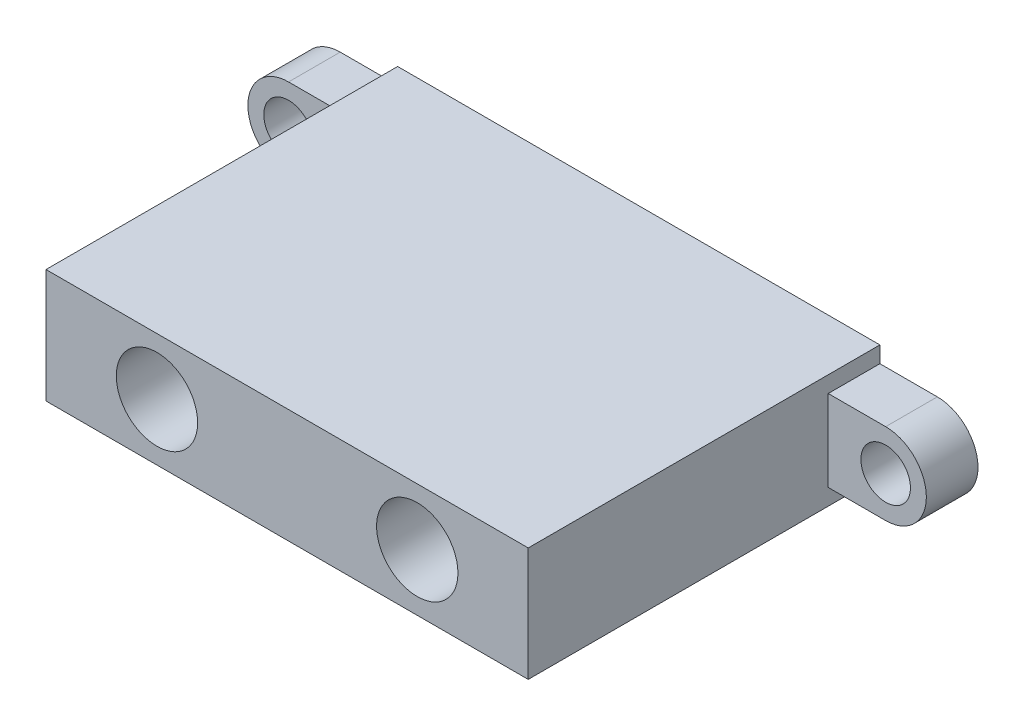
ISO-10303-21;
HEADER;
FILE_DESCRIPTION(('STEP AP214'),'2;1');
FILE_NAME('part.step','',(''),(''),'','','');
FILE_SCHEMA(('AUTOMOTIVE_DESIGN { 1 0 10303 214 1 1 1 1 }'));
ENDSEC;
DATA;
#1=APPLICATION_CONTEXT('core data for automotive mechanical design processes');
#2=APPLICATION_PROTOCOL_DEFINITION('international standard','automotive_design',2000,#1);
#3=PRODUCT_CONTEXT('',#1,'mechanical');
#4=PRODUCT('Part','Part','',(#3));
#5=PRODUCT_RELATED_PRODUCT_CATEGORY('part','',(#4));
#6=PRODUCT_DEFINITION_FORMATION('','',#4);
#7=PRODUCT_DEFINITION_CONTEXT('part definition',#1,'design');
#8=PRODUCT_DEFINITION('design','',#6,#7);
#9=PRODUCT_DEFINITION_SHAPE('','',#8);
#10=(LENGTH_UNIT() NAMED_UNIT(*) SI_UNIT(.MILLI.,.METRE.));
#11=(NAMED_UNIT(*) PLANE_ANGLE_UNIT() SI_UNIT($,.RADIAN.));
#12=(NAMED_UNIT(*) SI_UNIT($,.STERADIAN.) SOLID_ANGLE_UNIT());
#13=UNCERTAINTY_MEASURE_WITH_UNIT(LENGTH_MEASURE(1.E-05),#10,'distance_accuracy_value','');
#14=(GEOMETRIC_REPRESENTATION_CONTEXT(3) GLOBAL_UNCERTAINTY_ASSIGNED_CONTEXT((#13)) GLOBAL_UNIT_ASSIGNED_CONTEXT((#10,
#11,#12)) REPRESENTATION_CONTEXT('',''));
#15=CARTESIAN_POINT('',(0.,0.,0.));
#16=DIRECTION('',(0.,0.,1.));
#17=DIRECTION('',(1.,0.,0.));
#18=AXIS2_PLACEMENT_3D('',#15,#16,#17);
#19=CARTESIAN_POINT('',(0.,0.,21.6154));
#20=DIRECTION('',(1.,0.,0.));
#21=DIRECTION('',(0.,0.,-1.));
#22=AXIS2_PLACEMENT_3D('',#19,#20,#21);
#23=PLANE('',#22);
#24=DIRECTION('',(0.,-1.,0.));
#25=VECTOR('',#24,1.);
#26=CARTESIAN_POINT('',(0.,0.,0.));
#27=LINE('',#26,#25);
#28=CARTESIAN_POINT('',(0.,7.,0.));
#29=VERTEX_POINT('',#28);
#30=CARTESIAN_POINT('',(0.,6.,0.));
#31=VERTEX_POINT('',#30);
#32=EDGE_CURVE('E225',#29,#31,#27,.T.);
#33=ORIENTED_EDGE('',*,*,#32,.T.);
#34=DIRECTION('',(0.,0.,1.));
#35=VECTOR('',#34,1.);
#36=CARTESIAN_POINT('',(0.,6.,21.6154));
#37=LINE('',#36,#35);
#38=CARTESIAN_POINT('',(0.,6.,3.175));
#39=VERTEX_POINT('',#38);
#40=EDGE_CURVE('E56',#31,#39,#37,.T.);
#41=ORIENTED_EDGE('',*,*,#40,.T.);
#42=DIRECTION('',(0.,1.,0.));
#43=VECTOR('',#42,1.);
#44=CARTESIAN_POINT('',(0.,0.,3.175));
#45=LINE('',#44,#43);
#46=CARTESIAN_POINT('',(0.,1.,3.175));
#47=VERTEX_POINT('',#46);
#48=EDGE_CURVE('E60',#47,#39,#45,.T.);
#49=ORIENTED_EDGE('',*,*,#48,.F.);
#50=DIRECTION('',(0.,0.,-1.));
#51=VECTOR('',#50,1.);
#52=CARTESIAN_POINT('',(0.,1.,21.6154));
#53=LINE('',#52,#51);
#54=CARTESIAN_POINT('',(0.,1.,0.));
#55=VERTEX_POINT('',#54);
#56=EDGE_CURVE('E198',#47,#55,#53,.T.);
#57=ORIENTED_EDGE('',*,*,#56,.T.);
#58=CARTESIAN_POINT('',(0.,0.,0.));
#59=VERTEX_POINT('',#58);
#60=EDGE_CURVE('E209',#55,#59,#27,.T.);
#61=ORIENTED_EDGE('',*,*,#60,.T.);
#62=DIRECTION('',(0.,0.,-1.));
#63=VECTOR('',#62,1.);
#64=CARTESIAN_POINT('',(0.,0.,21.6154));
#65=LINE('',#64,#63);
#66=CARTESIAN_POINT('',(0.,0.,21.6154));
#67=VERTEX_POINT('',#66);
#68=EDGE_CURVE('E49',#67,#59,#65,.T.);
#69=ORIENTED_EDGE('',*,*,#68,.F.);
#70=DIRECTION('',(0.,-1.,0.));
#71=VECTOR('',#70,1.);
#72=CARTESIAN_POINT('',(0.,0.,21.6154));
#73=LINE('',#72,#71);
#74=CARTESIAN_POINT('',(0.,7.,21.6154));
#75=VERTEX_POINT('',#74);
#76=EDGE_CURVE('E210',#75,#67,#73,.T.);
#77=ORIENTED_EDGE('',*,*,#76,.F.);
#78=DIRECTION('',(0.,0.,-1.));
#79=VECTOR('',#78,1.);
#80=CARTESIAN_POINT('',(0.,7.,21.6154));
#81=LINE('',#80,#79);
#82=EDGE_CURVE('E224',#75,#29,#81,.T.);
#83=ORIENTED_EDGE('',*,*,#82,.T.);
#84=EDGE_LOOP('',(#33,#41,#49,#57,#61,#69,#77,#83));
#85=FACE_BOUND('',#84,.T.);
#86=ADVANCED_FACE('F41',(#85),#23,.F.);
#87=CARTESIAN_POINT('',(0.,0.,21.6154));
#88=DIRECTION('',(0.,1.,0.));
#89=DIRECTION('',(0.,0.,1.));
#90=AXIS2_PLACEMENT_3D('',#87,#88,#89);
#91=PLANE('',#90);
#92=DIRECTION('',(1.,0.,0.));
#93=VECTOR('',#92,1.);
#94=CARTESIAN_POINT('',(0.,0.,0.));
#95=LINE('',#94,#93);
#96=CARTESIAN_POINT('',(29.6418,0.,0.));
#97=VERTEX_POINT('',#96);
#98=EDGE_CURVE('E228',#59,#97,#95,.T.);
#99=ORIENTED_EDGE('',*,*,#98,.T.);
#100=DIRECTION('',(0.,0.,-1.));
#101=VECTOR('',#100,1.);
#102=CARTESIAN_POINT('',(29.6418,0.,21.6154));
#103=LINE('',#102,#101);
#104=CARTESIAN_POINT('',(29.6418,0.,21.6154));
#105=VERTEX_POINT('',#104);
#106=EDGE_CURVE('E244',#105,#97,#103,.T.);
#107=ORIENTED_EDGE('',*,*,#106,.F.);
#108=DIRECTION('',(1.,0.,0.));
#109=VECTOR('',#108,1.);
#110=CARTESIAN_POINT('',(0.,0.,21.6154));
#111=LINE('',#110,#109);
#112=EDGE_CURVE('E214',#67,#105,#111,.T.);
#113=ORIENTED_EDGE('',*,*,#112,.F.);
#114=ORIENTED_EDGE('',*,*,#68,.T.);
#115=EDGE_LOOP('',(#99,#107,#113,#114));
#116=FACE_BOUND('',#115,.T.);
#117=ADVANCED_FACE('F251',(#116),#91,.F.);
#118=CARTESIAN_POINT('',(29.6418,0.,21.6154));
#119=DIRECTION('',(-1.,0.,0.));
#120=DIRECTION('',(0.,0.,1.));
#121=AXIS2_PLACEMENT_3D('',#118,#119,#120);
#122=PLANE('',#121);
#123=DIRECTION('',(0.,-1.,0.));
#124=VECTOR('',#123,1.);
#125=CARTESIAN_POINT('',(29.6418,0.,3.175));
#126=LINE('',#125,#124);
#127=CARTESIAN_POINT('',(29.6418,6.,3.175));
#128=VERTEX_POINT('',#127);
#129=CARTESIAN_POINT('',(29.6418,1.,3.175));
#130=VERTEX_POINT('',#129);
#131=EDGE_CURVE('E11',#128,#130,#126,.T.);
#132=ORIENTED_EDGE('',*,*,#131,.F.);
#133=DIRECTION('',(0.,0.,-1.));
#134=VECTOR('',#133,1.);
#135=CARTESIAN_POINT('',(29.6418,6.,21.6154));
#136=LINE('',#135,#134);
#137=CARTESIAN_POINT('',(29.6418,6.,0.));
#138=VERTEX_POINT('',#137);
#139=EDGE_CURVE('E201',#128,#138,#136,.T.);
#140=ORIENTED_EDGE('',*,*,#139,.T.);
#141=DIRECTION('',(0.,1.,0.));
#142=VECTOR('',#141,1.);
#143=CARTESIAN_POINT('',(29.6418,0.,0.));
#144=LINE('',#143,#142);
#145=CARTESIAN_POINT('',(29.6418,7.,0.));
#146=VERTEX_POINT('',#145);
#147=EDGE_CURVE('E231',#138,#146,#144,.T.);
#148=ORIENTED_EDGE('',*,*,#147,.T.);
#149=DIRECTION('',(0.,0.,-1.));
#150=VECTOR('',#149,1.);
#151=CARTESIAN_POINT('',(29.6418,7.,21.6154));
#152=LINE('',#151,#150);
#153=CARTESIAN_POINT('',(29.6418,7.,21.6154));
#154=VERTEX_POINT('',#153);
#155=EDGE_CURVE('E240',#154,#146,#152,.T.);
#156=ORIENTED_EDGE('',*,*,#155,.F.);
#157=DIRECTION('',(0.,1.,0.));
#158=VECTOR('',#157,1.);
#159=CARTESIAN_POINT('',(29.6418,0.,21.6154));
#160=LINE('',#159,#158);
#161=EDGE_CURVE('E218',#105,#154,#160,.T.);
#162=ORIENTED_EDGE('',*,*,#161,.F.);
#163=ORIENTED_EDGE('',*,*,#106,.T.);
#164=CARTESIAN_POINT('',(29.6418,1.,0.));
#165=VERTEX_POINT('',#164);
#166=EDGE_CURVE('E232',#97,#165,#144,.T.);
#167=ORIENTED_EDGE('',*,*,#166,.T.);
#168=DIRECTION('',(0.,0.,1.));
#169=VECTOR('',#168,1.);
#170=CARTESIAN_POINT('',(29.6418,1.,21.6154));
#171=LINE('',#170,#169);
#172=EDGE_CURVE('E189',#165,#130,#171,.T.);
#173=ORIENTED_EDGE('',*,*,#172,.T.);
#174=EDGE_LOOP('',(#132,#140,#148,#156,#162,#163,#167,#173));
#175=FACE_BOUND('',#174,.T.);
#176=ADVANCED_FACE('F262',(#175),#122,.F.);
#177=CARTESIAN_POINT('',(0.,7.,21.6154));
#178=DIRECTION('',(0.,-1.,0.));
#179=DIRECTION('',(0.,0.,-1.));
#180=AXIS2_PLACEMENT_3D('',#177,#178,#179);
#181=PLANE('',#180);
#182=DIRECTION('',(-1.,0.,0.));
#183=VECTOR('',#182,1.);
#184=CARTESIAN_POINT('',(0.,7.,0.));
#185=LINE('',#184,#183);
#186=EDGE_CURVE('E215',#146,#29,#185,.T.);
#187=ORIENTED_EDGE('',*,*,#186,.T.);
#188=ORIENTED_EDGE('',*,*,#82,.F.);
#189=DIRECTION('',(-1.,0.,0.));
#190=VECTOR('',#189,1.);
#191=CARTESIAN_POINT('',(0.,7.,21.6154));
#192=LINE('',#191,#190);
#193=EDGE_CURVE('E221',#154,#75,#192,.T.);
#194=ORIENTED_EDGE('',*,*,#193,.F.);
#195=ORIENTED_EDGE('',*,*,#155,.T.);
#196=EDGE_LOOP('',(#187,#188,#194,#195));
#197=FACE_BOUND('',#196,.T.);
#198=ADVANCED_FACE('F270',(#197),#181,.F.);
#199=CARTESIAN_POINT('',(0.,0.,21.6154));
#200=DIRECTION('',(0.,0.,-1.));
#201=DIRECTION('',(-1.,0.,0.));
#202=AXIS2_PLACEMENT_3D('',#199,#200,#201);
#203=PLANE('',#202);
#204=CARTESIAN_POINT('',(6.8209,3.5,21.6154));
#205=DIRECTION('',(0.,0.,1.));
#206=DIRECTION('',(1.,0.,0.));
#207=AXIS2_PLACEMENT_3D('',#204,#205,#206);
#208=CIRCLE('',#207,2.5);
#209=CARTESIAN_POINT('',(9.3209,3.5,21.6154));
#210=VERTEX_POINT('',#209);
#211=EDGE_CURVE('E363',#210,#210,#208,.T.);
#212=ORIENTED_EDGE('',*,*,#211,.F.);
#213=EDGE_LOOP('',(#212));
#214=FACE_BOUND('',#213,.T.);
#215=CARTESIAN_POINT('',(22.8209,3.5,21.6154));
#216=DIRECTION('',(0.,0.,1.));
#217=DIRECTION('',(1.,0.,0.));
#218=AXIS2_PLACEMENT_3D('',#215,#216,#217);
#219=CIRCLE('',#218,2.5);
#220=CARTESIAN_POINT('',(25.3209,3.5,21.6154));
#221=VERTEX_POINT('',#220);
#222=EDGE_CURVE('E371',#221,#221,#219,.T.);
#223=ORIENTED_EDGE('',*,*,#222,.F.);
#224=EDGE_LOOP('',(#223));
#225=FACE_BOUND('',#224,.T.);
#226=ORIENTED_EDGE('',*,*,#76,.T.);
#227=ORIENTED_EDGE('',*,*,#112,.T.);
#228=ORIENTED_EDGE('',*,*,#161,.T.);
#229=ORIENTED_EDGE('',*,*,#193,.T.);
#230=EDGE_LOOP('',(#226,#227,#228,#229));
#231=FACE_BOUND('',#230,.T.);
#232=ADVANCED_FACE('F267',(#214,#225,#231),#203,.F.);
#233=CARTESIAN_POINT('',(0.,0.,0.));
#234=DIRECTION('',(0.,0.,-1.));
#235=DIRECTION('',(-1.,0.,0.));
#236=AXIS2_PLACEMENT_3D('',#233,#234,#235);
#237=PLANE('',#236);
#238=ORIENTED_EDGE('',*,*,#60,.F.);
#239=DIRECTION('',(-1.,0.,0.));
#240=VECTOR('',#239,1.);
#241=CARTESIAN_POINT('',(33.1724,1.,0.));
#242=LINE('',#241,#240);
#243=CARTESIAN_POINT('',(-3.5306,1.,0.));
#244=VERTEX_POINT('',#243);
#245=EDGE_CURVE('E179',#55,#244,#242,.T.);
#246=ORIENTED_EDGE('',*,*,#245,.T.);
#247=CARTESIAN_POINT('',(-3.5306,3.5,0.));
#248=DIRECTION('',(0.,0.,-1.));
#249=DIRECTION('',(-1.,0.,0.));
#250=AXIS2_PLACEMENT_3D('',#247,#248,#249);
#251=CIRCLE('',#250,2.5);
#252=CARTESIAN_POINT('',(-3.5306,6.,0.));
#253=VERTEX_POINT('',#252);
#254=EDGE_CURVE('E183',#244,#253,#251,.T.);
#255=ORIENTED_EDGE('',*,*,#254,.T.);
#256=DIRECTION('',(1.,0.,0.));
#257=VECTOR('',#256,1.);
#258=CARTESIAN_POINT('',(33.1724,6.,0.));
#259=LINE('',#258,#257);
#260=EDGE_CURVE('E158',#253,#31,#259,.T.);
#261=ORIENTED_EDGE('',*,*,#260,.T.);
#262=ORIENTED_EDGE('',*,*,#32,.F.);
#263=ORIENTED_EDGE('',*,*,#186,.F.);
#264=ORIENTED_EDGE('',*,*,#147,.F.);
#265=CARTESIAN_POINT('',(33.1724,6.,0.));
#266=VERTEX_POINT('',#265);
#267=EDGE_CURVE('E163',#138,#266,#259,.T.);
#268=ORIENTED_EDGE('',*,*,#267,.T.);
#269=CARTESIAN_POINT('',(33.1724,3.5,0.));
#270=DIRECTION('',(0.,0.,-1.));
#271=DIRECTION('',(-1.,0.,0.));
#272=AXIS2_PLACEMENT_3D('',#269,#270,#271);
#273=CIRCLE('',#272,2.5);
#274=CARTESIAN_POINT('',(33.1724,1.,0.));
#275=VERTEX_POINT('',#274);
#276=EDGE_CURVE('E176',#266,#275,#273,.T.);
#277=ORIENTED_EDGE('',*,*,#276,.T.);
#278=EDGE_CURVE('E135',#275,#165,#242,.T.);
#279=ORIENTED_EDGE('',*,*,#278,.T.);
#280=ORIENTED_EDGE('',*,*,#166,.F.);
#281=ORIENTED_EDGE('',*,*,#98,.F.);
#282=EDGE_LOOP('',(#238,#246,#255,#261,#262,#263,#264,#268,#277,#279,#280,#281));
#283=FACE_BOUND('',#282,.T.);
#284=CARTESIAN_POINT('',(33.1724,3.5,0.));
#285=DIRECTION('',(0.,0.,-1.));
#286=DIRECTION('',(-1.,0.,0.));
#287=AXIS2_PLACEMENT_3D('',#284,#285,#286);
#288=CIRCLE('',#287,1.524);
#289=CARTESIAN_POINT('',(31.6484,3.5,0.));
#290=VERTEX_POINT('',#289);
#291=EDGE_CURVE('E166',#290,#290,#288,.T.);
#292=ORIENTED_EDGE('',*,*,#291,.F.);
#293=EDGE_LOOP('',(#292));
#294=FACE_BOUND('',#293,.T.);
#295=CARTESIAN_POINT('',(-3.5306,3.5,0.));
#296=DIRECTION('',(0.,0.,-1.));
#297=DIRECTION('',(-1.,0.,0.));
#298=AXIS2_PLACEMENT_3D('',#295,#296,#297);
#299=CIRCLE('',#298,1.524);
#300=CARTESIAN_POINT('',(-5.0546,3.5,0.));
#301=VERTEX_POINT('',#300);
#302=EDGE_CURVE('E355',#301,#301,#299,.T.);
#303=ORIENTED_EDGE('',*,*,#302,.F.);
#304=EDGE_LOOP('',(#303));
#305=FACE_BOUND('',#304,.T.);
#306=ADVANCED_FACE('F259',(#283,#294,#305),#237,.T.);
#307=CARTESIAN_POINT('',(33.1724,3.5,3.175));
#308=DIRECTION('',(0.,0.,-1.));
#309=DIRECTION('',(-1.,0.,0.));
#310=AXIS2_PLACEMENT_3D('',#307,#308,#309);
#311=CYLINDRICAL_SURFACE('',#310,2.5);
#312=ORIENTED_EDGE('',*,*,#276,.F.);
#313=DIRECTION('',(0.,0.,-1.));
#314=VECTOR('',#313,1.);
#315=CARTESIAN_POINT('',(33.1724,6.,3.175));
#316=LINE('',#315,#314);
#317=CARTESIAN_POINT('',(33.1724,6.,3.175));
#318=VERTEX_POINT('',#317);
#319=EDGE_CURVE('E156',#318,#266,#316,.T.);
#320=ORIENTED_EDGE('',*,*,#319,.F.);
#321=CARTESIAN_POINT('',(33.1724,3.5,3.175));
#322=DIRECTION('',(0.,0.,-1.));
#323=DIRECTION('',(-1.,0.,0.));
#324=AXIS2_PLACEMENT_3D('',#321,#322,#323);
#325=CIRCLE('',#324,2.5);
#326=CARTESIAN_POINT('',(33.1724,1.,3.175));
#327=VERTEX_POINT('',#326);
#328=EDGE_CURVE('E148',#318,#327,#325,.T.);
#329=ORIENTED_EDGE('',*,*,#328,.T.);
#330=DIRECTION('',(0.,0.,-1.));
#331=VECTOR('',#330,1.);
#332=CARTESIAN_POINT('',(33.1724,1.,3.175));
#333=LINE('',#332,#331);
#334=EDGE_CURVE('E129',#327,#275,#333,.T.);
#335=ORIENTED_EDGE('',*,*,#334,.T.);
#336=EDGE_LOOP('',(#312,#320,#329,#335));
#337=FACE_BOUND('',#336,.T.);
#338=ADVANCED_FACE('F154',(#337),#311,.T.);
#339=CARTESIAN_POINT('',(33.1724,3.5,3.175));
#340=DIRECTION('',(0.,0.,-1.));
#341=DIRECTION('',(-1.,0.,0.));
#342=AXIS2_PLACEMENT_3D('',#339,#340,#341);
#343=CYLINDRICAL_SURFACE('',#342,1.524);
#344=CARTESIAN_POINT('',(33.1724,3.5,3.175));
#345=DIRECTION('',(0.,0.,-1.));
#346=DIRECTION('',(-1.,0.,0.));
#347=AXIS2_PLACEMENT_3D('',#344,#345,#346);
#348=CIRCLE('',#347,1.524);
#349=CARTESIAN_POINT('',(31.6484,3.5,3.175));
#350=VERTEX_POINT('',#349);
#351=EDGE_CURVE('E180',#350,#350,#348,.T.);
#352=ORIENTED_EDGE('',*,*,#351,.F.);
#353=EDGE_LOOP('',(#352));
#354=FACE_BOUND('',#353,.T.);
#355=ORIENTED_EDGE('',*,*,#291,.T.);
#356=EDGE_LOOP('',(#355));
#357=FACE_BOUND('',#356,.T.);
#358=ADVANCED_FACE('F316',(#354,#357),#343,.F.);
#359=CARTESIAN_POINT('',(33.1724,3.5,3.175));
#360=DIRECTION('',(0.,0.,-1.));
#361=DIRECTION('',(-1.,0.,0.));
#362=AXIS2_PLACEMENT_3D('',#359,#360,#361);
#363=PLANE('',#362);
#364=ORIENTED_EDGE('',*,*,#351,.T.);
#365=EDGE_LOOP('',(#364));
#366=FACE_BOUND('',#365,.T.);
#367=DIRECTION('',(1.,0.,0.));
#368=VECTOR('',#367,1.);
#369=CARTESIAN_POINT('',(33.1724,6.,3.175));
#370=LINE('',#369,#368);
#371=EDGE_CURVE('E172',#128,#318,#370,.T.);
#372=ORIENTED_EDGE('',*,*,#371,.F.);
#373=ORIENTED_EDGE('',*,*,#131,.T.);
#374=DIRECTION('',(-1.,0.,0.));
#375=VECTOR('',#374,1.);
#376=CARTESIAN_POINT('',(33.1724,1.,3.175));
#377=LINE('',#376,#375);
#378=EDGE_CURVE('E133',#327,#130,#377,.T.);
#379=ORIENTED_EDGE('',*,*,#378,.F.);
#380=ORIENTED_EDGE('',*,*,#328,.F.);
#381=EDGE_LOOP('',(#372,#373,#379,#380));
#382=FACE_BOUND('',#381,.T.);
#383=ADVANCED_FACE('F147',(#366,#382),#363,.F.);
#384=CARTESIAN_POINT('',(33.1724,1.,3.175));
#385=DIRECTION('',(0.,-1.,0.));
#386=DIRECTION('',(0.,0.,-1.));
#387=AXIS2_PLACEMENT_3D('',#384,#385,#386);
#388=PLANE('',#387);
#389=ORIENTED_EDGE('',*,*,#172,.F.);
#390=ORIENTED_EDGE('',*,*,#278,.F.);
#391=ORIENTED_EDGE('',*,*,#334,.F.);
#392=ORIENTED_EDGE('',*,*,#378,.T.);
#393=EDGE_LOOP('',(#389,#390,#391,#392));
#394=FACE_BOUND('',#393,.T.);
#395=ADVANCED_FACE('F132',(#394),#388,.T.);
#396=CARTESIAN_POINT('',(33.1724,6.,3.175));
#397=DIRECTION('',(0.,1.,0.));
#398=DIRECTION('',(0.,0.,1.));
#399=AXIS2_PLACEMENT_3D('',#396,#397,#398);
#400=PLANE('',#399);
#401=ORIENTED_EDGE('',*,*,#139,.F.);
#402=ORIENTED_EDGE('',*,*,#371,.T.);
#403=ORIENTED_EDGE('',*,*,#319,.T.);
#404=ORIENTED_EDGE('',*,*,#267,.F.);
#405=EDGE_LOOP('',(#401,#402,#403,#404));
#406=FACE_BOUND('',#405,.T.);
#407=ADVANCED_FACE('F331',(#406),#400,.T.);
#408=CARTESIAN_POINT('',(-3.5306,3.5,3.175));
#409=DIRECTION('',(0.,0.,-1.));
#410=DIRECTION('',(-1.,0.,0.));
#411=AXIS2_PLACEMENT_3D('',#408,#409,#410);
#412=CIRCLE('',#411,1.524);
#413=CARTESIAN_POINT('',(-5.0546,3.5,3.175));
#414=VERTEX_POINT('',#413);
#415=EDGE_CURVE('E352',#414,#414,#412,.T.);
#416=ORIENTED_EDGE('',*,*,#415,.T.);
#417=EDGE_LOOP('',(#416));
#418=FACE_BOUND('',#417,.T.);
#419=CARTESIAN_POINT('',(-3.5306,1.,3.175));
#420=VERTEX_POINT('',#419);
#421=EDGE_CURVE('E151',#47,#420,#377,.T.);
#422=ORIENTED_EDGE('',*,*,#421,.F.);
#423=ORIENTED_EDGE('',*,*,#48,.T.);
#424=CARTESIAN_POINT('',(-3.5306,6.,3.175));
#425=VERTEX_POINT('',#424);
#426=EDGE_CURVE('E142',#425,#39,#370,.T.);
#427=ORIENTED_EDGE('',*,*,#426,.F.);
#428=CARTESIAN_POINT('',(-3.5306,3.5,3.175));
#429=DIRECTION('',(0.,0.,-1.));
#430=DIRECTION('',(-1.,0.,0.));
#431=AXIS2_PLACEMENT_3D('',#428,#429,#430);
#432=CIRCLE('',#431,2.5);
#433=EDGE_CURVE('E150',#420,#425,#432,.T.);
#434=ORIENTED_EDGE('',*,*,#433,.F.);
#435=EDGE_LOOP('',(#422,#423,#427,#434));
#436=FACE_BOUND('',#435,.T.);
#437=ADVANCED_FACE('F281',(#418,#436),#363,.F.);
#438=ORIENTED_EDGE('',*,*,#40,.F.);
#439=ORIENTED_EDGE('',*,*,#260,.F.);
#440=DIRECTION('',(0.,0.,-1.));
#441=VECTOR('',#440,1.);
#442=CARTESIAN_POINT('',(-3.5306,6.,3.175));
#443=LINE('',#442,#441);
#444=EDGE_CURVE('E190',#425,#253,#443,.T.);
#445=ORIENTED_EDGE('',*,*,#444,.F.);
#446=ORIENTED_EDGE('',*,*,#426,.T.);
#447=EDGE_LOOP('',(#438,#439,#445,#446));
#448=FACE_BOUND('',#447,.T.);
#449=ADVANCED_FACE('F276',(#448),#400,.T.);
#450=ORIENTED_EDGE('',*,*,#56,.F.);
#451=ORIENTED_EDGE('',*,*,#421,.T.);
#452=DIRECTION('',(0.,0.,-1.));
#453=VECTOR('',#452,1.);
#454=CARTESIAN_POINT('',(-3.5306,1.,3.175));
#455=LINE('',#454,#453);
#456=EDGE_CURVE('E141',#420,#244,#455,.T.);
#457=ORIENTED_EDGE('',*,*,#456,.T.);
#458=ORIENTED_EDGE('',*,*,#245,.F.);
#459=EDGE_LOOP('',(#450,#451,#457,#458));
#460=FACE_BOUND('',#459,.T.);
#461=ADVANCED_FACE('F284',(#460),#388,.T.);
#462=CARTESIAN_POINT('',(-3.5306,3.5,3.175));
#463=DIRECTION('',(0.,0.,-1.));
#464=DIRECTION('',(-1.,0.,0.));
#465=AXIS2_PLACEMENT_3D('',#462,#463,#464);
#466=CYLINDRICAL_SURFACE('',#465,2.5);
#467=ORIENTED_EDGE('',*,*,#254,.F.);
#468=ORIENTED_EDGE('',*,*,#456,.F.);
#469=ORIENTED_EDGE('',*,*,#433,.T.);
#470=ORIENTED_EDGE('',*,*,#444,.T.);
#471=EDGE_LOOP('',(#467,#468,#469,#470));
#472=FACE_BOUND('',#471,.T.);
#473=ADVANCED_FACE('F286',(#472),#466,.T.);
#474=CARTESIAN_POINT('',(-3.5306,3.5,3.175));
#475=DIRECTION('',(0.,0.,-1.));
#476=DIRECTION('',(-1.,0.,0.));
#477=AXIS2_PLACEMENT_3D('',#474,#475,#476);
#478=CYLINDRICAL_SURFACE('',#477,1.524);
#479=ORIENTED_EDGE('',*,*,#415,.F.);
#480=EDGE_LOOP('',(#479));
#481=FACE_BOUND('',#480,.T.);
#482=ORIENTED_EDGE('',*,*,#302,.T.);
#483=EDGE_LOOP('',(#482));
#484=FACE_BOUND('',#483,.T.);
#485=ADVANCED_FACE('F288',(#481,#484),#478,.F.);
#486=CARTESIAN_POINT('',(22.8209,3.5,17.8054));
#487=DIRECTION('',(0.,0.,1.));
#488=DIRECTION('',(1.,0.,0.));
#489=AXIS2_PLACEMENT_3D('',#486,#487,#488);
#490=CYLINDRICAL_SURFACE('',#489,2.5);
#491=CARTESIAN_POINT('',(22.8209,3.5,17.8054));
#492=DIRECTION('',(0.,0.,1.));
#493=DIRECTION('',(1.,0.,0.));
#494=AXIS2_PLACEMENT_3D('',#491,#492,#493);
#495=CIRCLE('',#494,2.5);
#496=CARTESIAN_POINT('',(25.3209,3.5,17.8054));
#497=VERTEX_POINT('',#496);
#498=EDGE_CURVE('E367',#497,#497,#495,.T.);
#499=ORIENTED_EDGE('',*,*,#498,.F.);
#500=EDGE_LOOP('',(#499));
#501=FACE_BOUND('',#500,.T.);
#502=ORIENTED_EDGE('',*,*,#222,.T.);
#503=EDGE_LOOP('',(#502));
#504=FACE_BOUND('',#503,.T.);
#505=ADVANCED_FACE('F294',(#501,#504),#490,.F.);
#506=CARTESIAN_POINT('',(22.8209,3.5,17.8054));
#507=DIRECTION('',(0.,0.,1.));
#508=DIRECTION('',(1.,0.,0.));
#509=AXIS2_PLACEMENT_3D('',#506,#507,#508);
#510=PLANE('',#509);
#511=ORIENTED_EDGE('',*,*,#498,.T.);
#512=EDGE_LOOP('',(#511));
#513=FACE_BOUND('',#512,.T.);
#514=ADVANCED_FACE('F379',(#513),#510,.T.);
#515=CARTESIAN_POINT('',(6.8209,3.5,17.8054));
#516=DIRECTION('',(0.,0.,1.));
#517=DIRECTION('',(1.,0.,0.));
#518=AXIS2_PLACEMENT_3D('',#515,#516,#517);
#519=CYLINDRICAL_SURFACE('',#518,2.5);
#520=CARTESIAN_POINT('',(6.8209,3.5,17.8054));
#521=DIRECTION('',(0.,0.,1.));
#522=DIRECTION('',(1.,0.,0.));
#523=AXIS2_PLACEMENT_3D('',#520,#521,#522);
#524=CIRCLE('',#523,2.5);
#525=CARTESIAN_POINT('',(9.3209,3.5,17.8054));
#526=VERTEX_POINT('',#525);
#527=EDGE_CURVE('E359',#526,#526,#524,.T.);
#528=ORIENTED_EDGE('',*,*,#527,.F.);
#529=EDGE_LOOP('',(#528));
#530=FACE_BOUND('',#529,.T.);
#531=ORIENTED_EDGE('',*,*,#211,.T.);
#532=EDGE_LOOP('',(#531));
#533=FACE_BOUND('',#532,.T.);
#534=ADVANCED_FACE('F384',(#530,#533),#519,.F.);
#535=CARTESIAN_POINT('',(6.8209,3.5,17.8054));
#536=DIRECTION('',(0.,0.,1.));
#537=DIRECTION('',(1.,0.,0.));
#538=AXIS2_PLACEMENT_3D('',#535,#536,#537);
#539=PLANE('',#538);
#540=ORIENTED_EDGE('',*,*,#527,.T.);
#541=EDGE_LOOP('',(#540));
#542=FACE_BOUND('',#541,.T.);
#543=ADVANCED_FACE('F391',(#542),#539,.T.);
#544=CLOSED_SHELL('',(#86,#117,#176,#198,#232,#306,#338,#358,#383,#395,#407,#437,#449,#461,#473,
#485,#505,#514,#534,#543));
#545=MANIFOLD_SOLID_BREP('B2',#544);
#546=ADVANCED_BREP_SHAPE_REPRESENTATION('',(#18,#545),#14);
#547=SHAPE_DEFINITION_REPRESENTATION(#9,#546);
ENDSEC;
END-ISO-10303-21;
